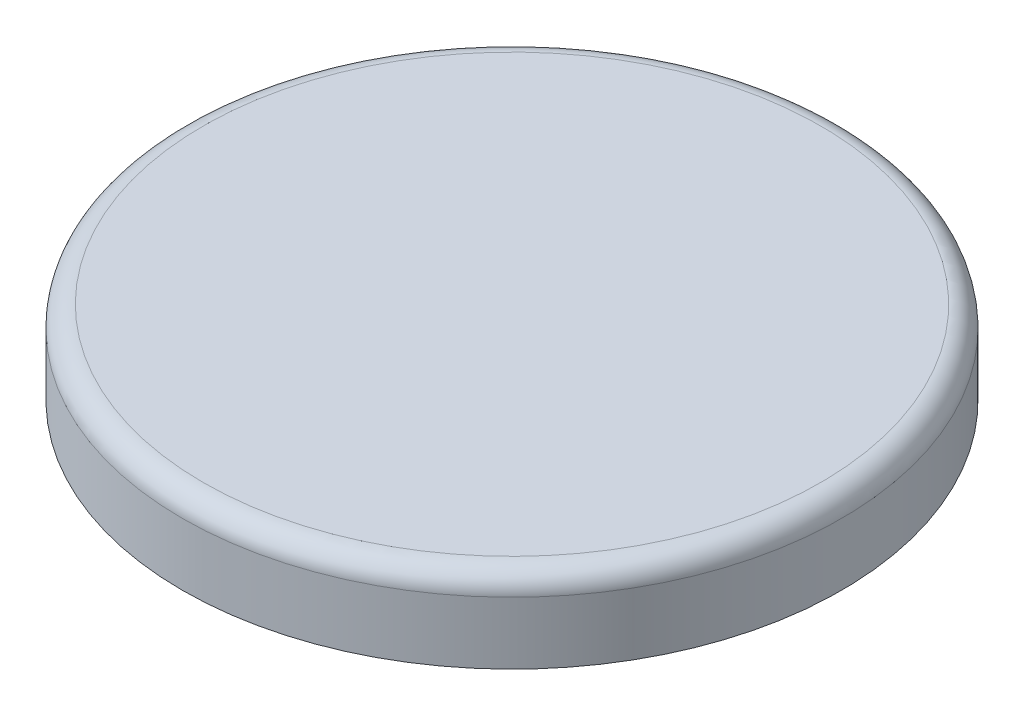
ISO-10303-21;
HEADER;
FILE_DESCRIPTION(('STEP AP214'),'2;1');
FILE_NAME('part.step','',(''),(''),'','','');
FILE_SCHEMA(('AUTOMOTIVE_DESIGN { 1 0 10303 214 1 1 1 1 }'));
ENDSEC;
DATA;
#1=APPLICATION_CONTEXT('core data for automotive mechanical design processes');
#2=APPLICATION_PROTOCOL_DEFINITION('international standard','automotive_design',2000,#1);
#3=PRODUCT_CONTEXT('',#1,'mechanical');
#4=PRODUCT('Part','Part','',(#3));
#5=PRODUCT_RELATED_PRODUCT_CATEGORY('part','',(#4));
#6=PRODUCT_DEFINITION_FORMATION('','',#4);
#7=PRODUCT_DEFINITION_CONTEXT('part definition',#1,'design');
#8=PRODUCT_DEFINITION('design','',#6,#7);
#9=PRODUCT_DEFINITION_SHAPE('','',#8);
#10=(LENGTH_UNIT() NAMED_UNIT(*) SI_UNIT(.MILLI.,.METRE.));
#11=(NAMED_UNIT(*) PLANE_ANGLE_UNIT() SI_UNIT($,.RADIAN.));
#12=(NAMED_UNIT(*) SI_UNIT($,.STERADIAN.) SOLID_ANGLE_UNIT());
#13=UNCERTAINTY_MEASURE_WITH_UNIT(LENGTH_MEASURE(1.E-05),#10,'distance_accuracy_value','');
#14=(GEOMETRIC_REPRESENTATION_CONTEXT(3) GLOBAL_UNCERTAINTY_ASSIGNED_CONTEXT((#13)) GLOBAL_UNIT_ASSIGNED_CONTEXT((#10,
#11,#12)) REPRESENTATION_CONTEXT('',''));
#15=CARTESIAN_POINT('',(0.,0.,0.));
#16=DIRECTION('',(0.,0.,1.));
#17=DIRECTION('',(1.,0.,0.));
#18=AXIS2_PLACEMENT_3D('',#15,#16,#17);
#19=CARTESIAN_POINT('',(0.,0.8,0.));
#20=DIRECTION('',(0.,-1.,0.));
#21=DIRECTION('',(0.,0.,-1.));
#22=AXIS2_PLACEMENT_3D('',#19,#20,#21);
#23=CYLINDRICAL_SURFACE('',#22,3.175);
#24=CARTESIAN_POINT('',(0.,0.6,0.));
#25=DIRECTION('',(0.,1.,0.));
#26=DIRECTION('',(0.,0.,1.));
#27=AXIS2_PLACEMENT_3D('',#24,#25,#26);
#28=CIRCLE('',#27,3.175);
#29=CARTESIAN_POINT('',(0.,0.6,3.175));
#30=VERTEX_POINT('',#29);
#31=EDGE_CURVE('E10',#30,#30,#28,.F.);
#32=ORIENTED_EDGE('',*,*,#31,.T.);
#33=EDGE_LOOP('',(#32));
#34=FACE_BOUND('',#33,.T.);
#35=CARTESIAN_POINT('',(0.,0.,0.));
#36=DIRECTION('',(0.,1.,0.));
#37=DIRECTION('',(0.,0.,1.));
#38=AXIS2_PLACEMENT_3D('',#35,#36,#37);
#39=CIRCLE('',#38,3.175);
#40=CARTESIAN_POINT('',(0.,0.,3.175));
#41=VERTEX_POINT('',#40);
#42=EDGE_CURVE('E54',#41,#41,#39,.T.);
#43=ORIENTED_EDGE('',*,*,#42,.T.);
#44=EDGE_LOOP('',(#43));
#45=FACE_BOUND('',#44,.T.);
#46=ADVANCED_FACE('F41',(#34,#45),#23,.T.);
#47=CARTESIAN_POINT('',(0.,0.8,0.));
#48=DIRECTION('',(0.,1.,0.));
#49=DIRECTION('',(0.,0.,1.));
#50=AXIS2_PLACEMENT_3D('',#47,#48,#49);
#51=PLANE('',#50);
#52=CARTESIAN_POINT('',(0.,0.8,0.));
#53=DIRECTION('',(0.,1.,0.));
#54=DIRECTION('',(0.,0.,1.));
#55=AXIS2_PLACEMENT_3D('',#52,#53,#54);
#56=CIRCLE('',#55,2.975);
#57=CARTESIAN_POINT('',(0.,0.8,2.975));
#58=VERTEX_POINT('',#57);
#59=EDGE_CURVE('E49',#58,#58,#56,.T.);
#60=ORIENTED_EDGE('',*,*,#59,.T.);
#61=EDGE_LOOP('',(#60));
#62=FACE_BOUND('',#61,.T.);
#63=ADVANCED_FACE('F65',(#62),#51,.T.);
#64=CARTESIAN_POINT('',(0.,0.,0.));
#65=DIRECTION('',(0.,1.,0.));
#66=DIRECTION('',(0.,0.,1.));
#67=AXIS2_PLACEMENT_3D('',#64,#65,#66);
#68=PLANE('',#67);
#69=ORIENTED_EDGE('',*,*,#42,.F.);
#70=EDGE_LOOP('',(#69));
#71=FACE_BOUND('',#70,.T.);
#72=ADVANCED_FACE('F63',(#71),#68,.F.);
#73=CARTESIAN_POINT('',(0.,0.6,0.));
#74=DIRECTION('',(0.,1.,0.));
#75=DIRECTION('',(0.,0.,1.));
#76=AXIS2_PLACEMENT_3D('',#73,#74,#75);
#77=TOROIDAL_SURFACE('',#76,2.975,0.2);
#78=ORIENTED_EDGE('',*,*,#31,.F.);
#79=EDGE_LOOP('',(#78));
#80=FACE_BOUND('',#79,.T.);
#81=ORIENTED_EDGE('',*,*,#59,.F.);
#82=EDGE_LOOP('',(#81));
#83=FACE_BOUND('',#82,.T.);
#84=ADVANCED_FACE('F43',(#80,#83),#77,.T.);
#85=CLOSED_SHELL('',(#46,#63,#72,#84));
#86=MANIFOLD_SOLID_BREP('B2',#85);
#87=ADVANCED_BREP_SHAPE_REPRESENTATION('',(#18,#86),#14);
#88=SHAPE_DEFINITION_REPRESENTATION(#9,#87);
ENDSEC;
END-ISO-10303-21;
